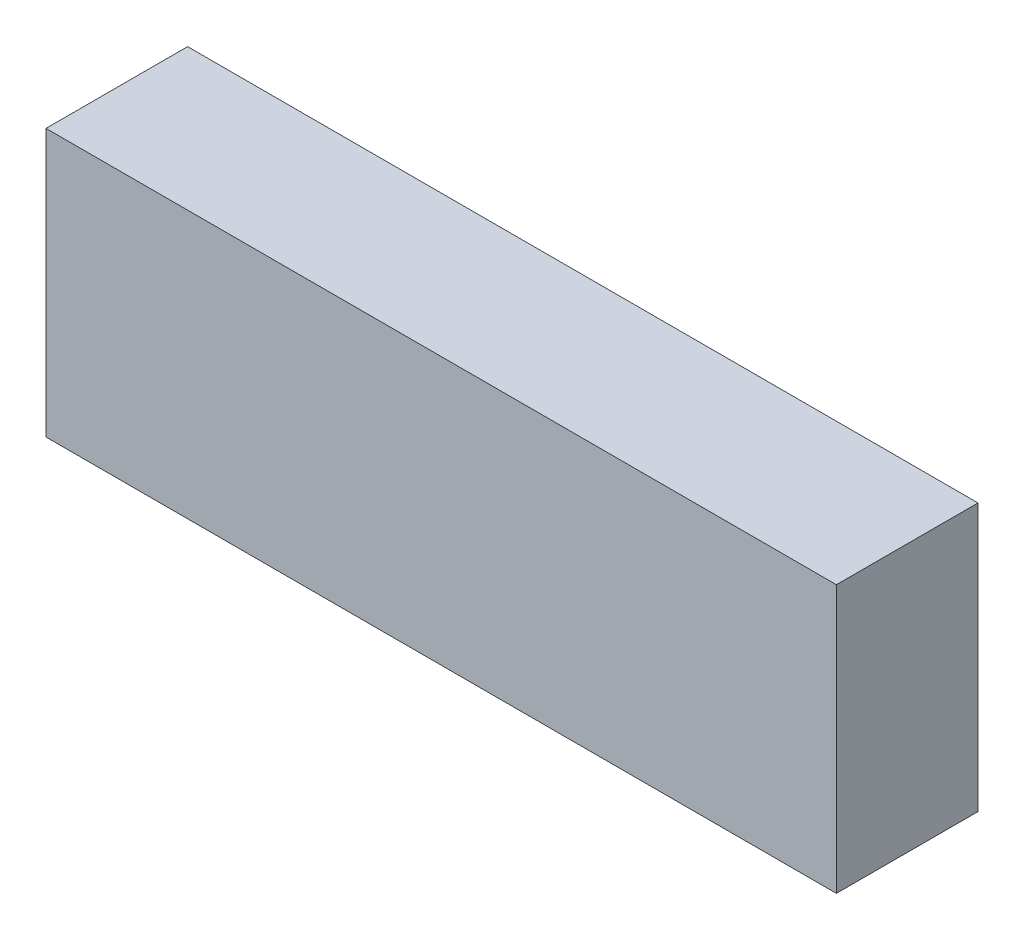
ISO-10303-21;
HEADER;
FILE_DESCRIPTION(('STEP AP214'),'2;1');
FILE_NAME('part.step','',(''),(''),'','','');
FILE_SCHEMA(('AUTOMOTIVE_DESIGN { 1 0 10303 214 1 1 1 1 }'));
ENDSEC;
DATA;
#1=APPLICATION_CONTEXT('core data for automotive mechanical design processes');
#2=APPLICATION_PROTOCOL_DEFINITION('international standard','automotive_design',2000,#1);
#3=PRODUCT_CONTEXT('',#1,'mechanical');
#4=PRODUCT('Part','Part','',(#3));
#5=PRODUCT_RELATED_PRODUCT_CATEGORY('part','',(#4));
#6=PRODUCT_DEFINITION_FORMATION('','',#4);
#7=PRODUCT_DEFINITION_CONTEXT('part definition',#1,'design');
#8=PRODUCT_DEFINITION('design','',#6,#7);
#9=PRODUCT_DEFINITION_SHAPE('','',#8);
#10=(LENGTH_UNIT() NAMED_UNIT(*) SI_UNIT(.MILLI.,.METRE.));
#11=(NAMED_UNIT(*) PLANE_ANGLE_UNIT() SI_UNIT($,.RADIAN.));
#12=(NAMED_UNIT(*) SI_UNIT($,.STERADIAN.) SOLID_ANGLE_UNIT());
#13=UNCERTAINTY_MEASURE_WITH_UNIT(LENGTH_MEASURE(1.E-05),#10,'distance_accuracy_value','');
#14=(GEOMETRIC_REPRESENTATION_CONTEXT(3) GLOBAL_UNCERTAINTY_ASSIGNED_CONTEXT((#13)) GLOBAL_UNIT_ASSIGNED_CONTEXT((#10,
#11,#12)) REPRESENTATION_CONTEXT('',''));
#15=CARTESIAN_POINT('',(0.,0.,0.));
#16=DIRECTION('',(0.,0.,1.));
#17=DIRECTION('',(1.,0.,0.));
#18=AXIS2_PLACEMENT_3D('',#15,#16,#17);
#19=CARTESIAN_POINT('',(69.4690000000001,-23.495,24.892));
#20=DIRECTION('',(-1.,0.,0.));
#21=DIRECTION('',(0.,0.,1.));
#22=AXIS2_PLACEMENT_3D('',#19,#20,#21);
#23=PLANE('',#22);
#24=DIRECTION('',(0.,1.,0.));
#25=VECTOR('',#24,1.);
#26=CARTESIAN_POINT('',(69.4690000000001,-23.495,0.));
#27=LINE('',#26,#25);
#28=CARTESIAN_POINT('',(69.4690000000001,-23.495,0.));
#29=VERTEX_POINT('',#28);
#30=CARTESIAN_POINT('',(69.4690000000001,23.495,0.));
#31=VERTEX_POINT('',#30);
#32=EDGE_CURVE('E107',#29,#31,#27,.T.);
#33=ORIENTED_EDGE('',*,*,#32,.T.);
#34=DIRECTION('',(0.,0.,-1.));
#35=VECTOR('',#34,1.);
#36=CARTESIAN_POINT('',(69.4690000000001,23.495,24.892));
#37=LINE('',#36,#35);
#38=CARTESIAN_POINT('',(69.4690000000001,23.495,24.892));
#39=VERTEX_POINT('',#38);
#40=EDGE_CURVE('E11',#39,#31,#37,.T.);
#41=ORIENTED_EDGE('',*,*,#40,.F.);
#42=DIRECTION('',(0.,1.,0.));
#43=VECTOR('',#42,1.);
#44=CARTESIAN_POINT('',(69.4690000000001,-23.495,24.892));
#45=LINE('',#44,#43);
#46=CARTESIAN_POINT('',(69.4690000000001,-23.495,24.892));
#47=VERTEX_POINT('',#46);
#48=EDGE_CURVE('E91',#47,#39,#45,.T.);
#49=ORIENTED_EDGE('',*,*,#48,.F.);
#50=DIRECTION('',(0.,0.,-1.));
#51=VECTOR('',#50,1.);
#52=CARTESIAN_POINT('',(69.4690000000001,-23.495,24.892));
#53=LINE('',#52,#51);
#54=EDGE_CURVE('E103',#47,#29,#53,.T.);
#55=ORIENTED_EDGE('',*,*,#54,.T.);
#56=EDGE_LOOP('',(#33,#41,#49,#55));
#57=FACE_BOUND('',#56,.T.);
#58=ADVANCED_FACE('F39',(#57),#23,.F.);
#59=CARTESIAN_POINT('',(-69.4689999999999,23.495,24.892));
#60=DIRECTION('',(0.,-1.,0.));
#61=DIRECTION('',(0.,0.,-1.));
#62=AXIS2_PLACEMENT_3D('',#59,#60,#61);
#63=PLANE('',#62);
#64=DIRECTION('',(-1.,0.,0.));
#65=VECTOR('',#64,1.);
#66=CARTESIAN_POINT('',(-69.4689999999999,23.495,0.));
#67=LINE('',#66,#65);
#68=CARTESIAN_POINT('',(-69.4689999999999,23.495,0.));
#69=VERTEX_POINT('',#68);
#70=EDGE_CURVE('E96',#31,#69,#67,.T.);
#71=ORIENTED_EDGE('',*,*,#70,.T.);
#72=DIRECTION('',(0.,0.,-1.));
#73=VECTOR('',#72,1.);
#74=CARTESIAN_POINT('',(-69.4689999999999,23.495,24.892));
#75=LINE('',#74,#73);
#76=CARTESIAN_POINT('',(-69.4689999999999,23.495,24.892));
#77=VERTEX_POINT('',#76);
#78=EDGE_CURVE('E48',#77,#69,#75,.T.);
#79=ORIENTED_EDGE('',*,*,#78,.F.);
#80=DIRECTION('',(-1.,0.,0.));
#81=VECTOR('',#80,1.);
#82=CARTESIAN_POINT('',(-69.4689999999999,23.495,24.892));
#83=LINE('',#82,#81);
#84=EDGE_CURVE('E86',#39,#77,#83,.T.);
#85=ORIENTED_EDGE('',*,*,#84,.F.);
#86=ORIENTED_EDGE('',*,*,#40,.T.);
#87=EDGE_LOOP('',(#71,#79,#85,#86));
#88=FACE_BOUND('',#87,.T.);
#89=ADVANCED_FACE('F95',(#88),#63,.F.);
#90=CARTESIAN_POINT('',(-69.4689999999999,-23.495,24.892));
#91=DIRECTION('',(1.,0.,0.));
#92=DIRECTION('',(0.,0.,-1.));
#93=AXIS2_PLACEMENT_3D('',#90,#91,#92);
#94=PLANE('',#93);
#95=DIRECTION('',(0.,-1.,0.));
#96=VECTOR('',#95,1.);
#97=CARTESIAN_POINT('',(-69.4689999999999,-23.495,0.));
#98=LINE('',#97,#96);
#99=CARTESIAN_POINT('',(-69.4689999999999,-23.495,0.));
#100=VERTEX_POINT('',#99);
#101=EDGE_CURVE('E73',#69,#100,#98,.T.);
#102=ORIENTED_EDGE('',*,*,#101,.T.);
#103=DIRECTION('',(0.,0.,-1.));
#104=VECTOR('',#103,1.);
#105=CARTESIAN_POINT('',(-69.4689999999999,-23.495,24.892));
#106=LINE('',#105,#104);
#107=CARTESIAN_POINT('',(-69.4689999999999,-23.495,24.892));
#108=VERTEX_POINT('',#107);
#109=EDGE_CURVE('E98',#108,#100,#106,.T.);
#110=ORIENTED_EDGE('',*,*,#109,.F.);
#111=DIRECTION('',(0.,-1.,0.));
#112=VECTOR('',#111,1.);
#113=CARTESIAN_POINT('',(-69.4689999999999,-23.495,24.892));
#114=LINE('',#113,#112);
#115=EDGE_CURVE('E89',#77,#108,#114,.T.);
#116=ORIENTED_EDGE('',*,*,#115,.F.);
#117=ORIENTED_EDGE('',*,*,#78,.T.);
#118=EDGE_LOOP('',(#102,#110,#116,#117));
#119=FACE_BOUND('',#118,.T.);
#120=ADVANCED_FACE('F99',(#119),#94,.F.);
#121=CARTESIAN_POINT('',(-69.4689999999999,-23.495,24.892));
#122=DIRECTION('',(0.,1.,0.));
#123=DIRECTION('',(0.,0.,1.));
#124=AXIS2_PLACEMENT_3D('',#121,#122,#123);
#125=PLANE('',#124);
#126=DIRECTION('',(1.,0.,0.));
#127=VECTOR('',#126,1.);
#128=CARTESIAN_POINT('',(-69.4689999999999,-23.495,0.));
#129=LINE('',#128,#127);
#130=EDGE_CURVE('E79',#100,#29,#129,.T.);
#131=ORIENTED_EDGE('',*,*,#130,.T.);
#132=ORIENTED_EDGE('',*,*,#54,.F.);
#133=DIRECTION('',(1.,0.,0.));
#134=VECTOR('',#133,1.);
#135=CARTESIAN_POINT('',(-69.4689999999999,-23.495,24.892));
#136=LINE('',#135,#134);
#137=EDGE_CURVE('E56',#108,#47,#136,.T.);
#138=ORIENTED_EDGE('',*,*,#137,.F.);
#139=ORIENTED_EDGE('',*,*,#109,.T.);
#140=EDGE_LOOP('',(#131,#132,#138,#139));
#141=FACE_BOUND('',#140,.T.);
#142=ADVANCED_FACE('F120',(#141),#125,.F.);
#143=CARTESIAN_POINT('',(0.,0.,24.892));
#144=DIRECTION('',(0.,0.,-1.));
#145=DIRECTION('',(-1.,0.,0.));
#146=AXIS2_PLACEMENT_3D('',#143,#144,#145);
#147=PLANE('',#146);
#148=ORIENTED_EDGE('',*,*,#48,.T.);
#149=ORIENTED_EDGE('',*,*,#84,.T.);
#150=ORIENTED_EDGE('',*,*,#115,.T.);
#151=ORIENTED_EDGE('',*,*,#137,.T.);
#152=EDGE_LOOP('',(#148,#149,#150,#151));
#153=FACE_BOUND('',#152,.T.);
#154=ADVANCED_FACE('F87',(#153),#147,.F.);
#155=CARTESIAN_POINT('',(0.,0.,0.));
#156=DIRECTION('',(0.,0.,-1.));
#157=DIRECTION('',(-1.,0.,0.));
#158=AXIS2_PLACEMENT_3D('',#155,#156,#157);
#159=PLANE('',#158);
#160=ORIENTED_EDGE('',*,*,#32,.F.);
#161=ORIENTED_EDGE('',*,*,#130,.F.);
#162=ORIENTED_EDGE('',*,*,#101,.F.);
#163=ORIENTED_EDGE('',*,*,#70,.F.);
#164=EDGE_LOOP('',(#160,#161,#162,#163));
#165=FACE_BOUND('',#164,.T.);
#166=ADVANCED_FACE('F123',(#165),#159,.T.);
#167=CLOSED_SHELL('',(#58,#89,#120,#142,#154,#166));
#168=MANIFOLD_SOLID_BREP('B2',#167);
#169=ADVANCED_BREP_SHAPE_REPRESENTATION('',(#18,#168),#14);
#170=SHAPE_DEFINITION_REPRESENTATION(#9,#169);
ENDSEC;
END-ISO-10303-21;
